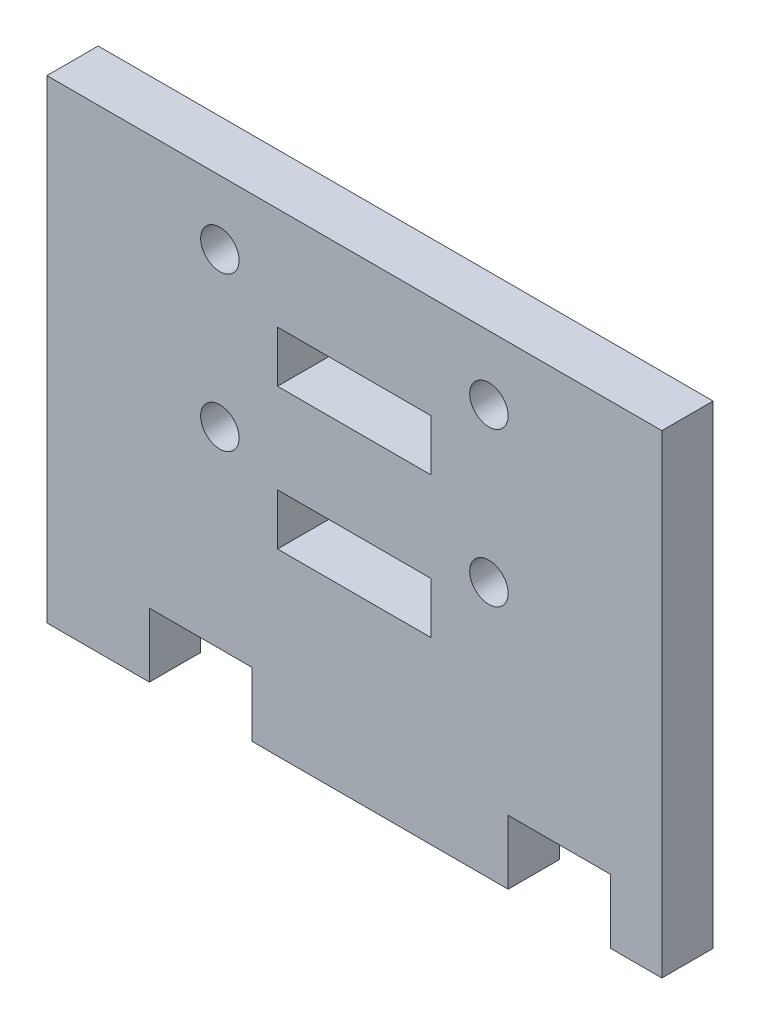
ISO-10303-21;
HEADER;
FILE_DESCRIPTION(('STEP AP214'),'2;1');
FILE_NAME('part.step','',(''),(''),'','','');
FILE_SCHEMA(('AUTOMOTIVE_DESIGN { 1 0 10303 214 1 1 1 1 }'));
ENDSEC;
DATA;
#1=APPLICATION_CONTEXT('core data for automotive mechanical design processes');
#2=APPLICATION_PROTOCOL_DEFINITION('international standard','automotive_design',2000,#1);
#3=PRODUCT_CONTEXT('',#1,'mechanical');
#4=PRODUCT('Part','Part','',(#3));
#5=PRODUCT_RELATED_PRODUCT_CATEGORY('part','',(#4));
#6=PRODUCT_DEFINITION_FORMATION('','',#4);
#7=PRODUCT_DEFINITION_CONTEXT('part definition',#1,'design');
#8=PRODUCT_DEFINITION('design','',#6,#7);
#9=PRODUCT_DEFINITION_SHAPE('','',#8);
#10=(LENGTH_UNIT() NAMED_UNIT(*) SI_UNIT(.MILLI.,.METRE.));
#11=(NAMED_UNIT(*) PLANE_ANGLE_UNIT() SI_UNIT($,.RADIAN.));
#12=(NAMED_UNIT(*) SI_UNIT($,.STERADIAN.) SOLID_ANGLE_UNIT());
#13=UNCERTAINTY_MEASURE_WITH_UNIT(LENGTH_MEASURE(1.E-05),#10,'distance_accuracy_value','');
#14=(GEOMETRIC_REPRESENTATION_CONTEXT(3) GLOBAL_UNCERTAINTY_ASSIGNED_CONTEXT((#13)) GLOBAL_UNIT_ASSIGNED_CONTEXT((#10,
#11,#12)) REPRESENTATION_CONTEXT('',''));
#15=CARTESIAN_POINT('',(0.,0.,0.));
#16=DIRECTION('',(0.,0.,1.));
#17=DIRECTION('',(1.,0.,0.));
#18=AXIS2_PLACEMENT_3D('',#15,#16,#17);
#19=CARTESIAN_POINT('',(0.,0.,2.));
#20=DIRECTION('',(0.,0.,-1.));
#21=DIRECTION('',(-1.,0.,0.));
#22=AXIS2_PLACEMENT_3D('',#19,#20,#21);
#23=PLANE('',#22);
#24=CARTESIAN_POINT('',(18.25,15.5,2.));
#25=DIRECTION('',(0.,0.,1.));
#26=DIRECTION('',(-1.,0.,0.));
#27=AXIS2_PLACEMENT_3D('',#24,#25,#26);
#28=CIRCLE('',#27,0.750000000000453);
#29=CARTESIAN_POINT('',(17.4999999999996,15.5,2.));
#30=VERTEX_POINT('',#29);
#31=EDGE_CURVE('E626',#30,#30,#28,.T.);
#32=ORIENTED_EDGE('',*,*,#31,.F.);
#33=EDGE_LOOP('',(#32));
#34=FACE_BOUND('',#33,.T.);
#35=DIRECTION('',(0.,-1.,0.));
#36=VECTOR('',#35,1.);
#37=CARTESIAN_POINT('',(10.,8.5,2.));
#38=LINE('',#37,#36);
#39=CARTESIAN_POINT('',(10.,8.5,2.));
#40=VERTEX_POINT('',#39);
#41=CARTESIAN_POINT('',(10.,6.5,2.));
#42=VERTEX_POINT('',#41);
#43=EDGE_CURVE('E169',#40,#42,#38,.T.);
#44=ORIENTED_EDGE('',*,*,#43,.F.);
#45=DIRECTION('',(-1.,0.,0.));
#46=VECTOR('',#45,1.);
#47=CARTESIAN_POINT('',(16.,8.5,2.));
#48=LINE('',#47,#46);
#49=CARTESIAN_POINT('',(16.,8.5,2.));
#50=VERTEX_POINT('',#49);
#51=EDGE_CURVE('E192',#50,#40,#48,.T.);
#52=ORIENTED_EDGE('',*,*,#51,.F.);
#53=DIRECTION('',(0.,1.,0.));
#54=VECTOR('',#53,1.);
#55=CARTESIAN_POINT('',(16.,6.5,2.));
#56=LINE('',#55,#54);
#57=CARTESIAN_POINT('',(16.,6.5,2.));
#58=VERTEX_POINT('',#57);
#59=EDGE_CURVE('E190',#58,#50,#56,.T.);
#60=ORIENTED_EDGE('',*,*,#59,.F.);
#61=DIRECTION('',(1.,0.,0.));
#62=VECTOR('',#61,1.);
#63=CARTESIAN_POINT('',(10.,6.5,2.));
#64=LINE('',#63,#62);
#65=EDGE_CURVE('E177',#42,#58,#64,.T.);
#66=ORIENTED_EDGE('',*,*,#65,.F.);
#67=EDGE_LOOP('',(#44,#52,#60,#66));
#68=FACE_BOUND('',#67,.T.);
#69=DIRECTION('',(1.,0.,0.));
#70=VECTOR('',#69,1.);
#71=CARTESIAN_POINT('',(10.,12.,2.));
#72=LINE('',#71,#70);
#73=CARTESIAN_POINT('',(10.,12.,2.));
#74=VERTEX_POINT('',#73);
#75=CARTESIAN_POINT('',(16.,12.,2.));
#76=VERTEX_POINT('',#75);
#77=EDGE_CURVE('E214',#74,#76,#72,.T.);
#78=ORIENTED_EDGE('',*,*,#77,.F.);
#79=DIRECTION('',(0.,-1.,0.));
#80=VECTOR('',#79,1.);
#81=CARTESIAN_POINT('',(10.,14.,2.));
#82=LINE('',#81,#80);
#83=CARTESIAN_POINT('',(10.,14.,2.));
#84=VERTEX_POINT('',#83);
#85=EDGE_CURVE('E222',#84,#74,#82,.T.);
#86=ORIENTED_EDGE('',*,*,#85,.F.);
#87=DIRECTION('',(-1.,0.,0.));
#88=VECTOR('',#87,1.);
#89=CARTESIAN_POINT('',(16.,14.,2.));
#90=LINE('',#89,#88);
#91=CARTESIAN_POINT('',(16.,14.,2.));
#92=VERTEX_POINT('',#91);
#93=EDGE_CURVE('E219',#92,#84,#90,.T.);
#94=ORIENTED_EDGE('',*,*,#93,.F.);
#95=DIRECTION('',(0.,1.,0.));
#96=VECTOR('',#95,1.);
#97=CARTESIAN_POINT('',(16.,12.,2.));
#98=LINE('',#97,#96);
#99=EDGE_CURVE('E216',#76,#92,#98,.T.);
#100=ORIENTED_EDGE('',*,*,#99,.F.);
#101=EDGE_LOOP('',(#78,#86,#94,#100));
#102=FACE_BOUND('',#101,.T.);
#103=DIRECTION('',(0.,-1.,0.));
#104=VECTOR('',#103,1.);
#105=CARTESIAN_POINT('',(0.999999999999993,-0.500000000000001,2.));
#106=LINE('',#105,#104);
#107=CARTESIAN_POINT('',(0.999999999999993,18.,2.));
#108=VERTEX_POINT('',#107);
#109=CARTESIAN_POINT('',(0.999999999999993,-0.500000000000001,2.));
#110=VERTEX_POINT('',#109);
#111=EDGE_CURVE('E245',#108,#110,#106,.T.);
#112=ORIENTED_EDGE('',*,*,#111,.T.);
#113=DIRECTION('',(1.,0.,0.));
#114=VECTOR('',#113,1.);
#115=CARTESIAN_POINT('',(4.99999999999999,-0.500000000000004,2.));
#116=LINE('',#115,#114);
#117=CARTESIAN_POINT('',(4.99999999999999,-0.500000000000004,2.));
#118=VERTEX_POINT('',#117);
#119=EDGE_CURVE('E248',#110,#118,#116,.T.);
#120=ORIENTED_EDGE('',*,*,#119,.T.);
#121=DIRECTION('',(0.,1.,0.));
#122=VECTOR('',#121,1.);
#123=CARTESIAN_POINT('',(4.99999999999999,1.99999999999999,2.));
#124=LINE('',#123,#122);
#125=CARTESIAN_POINT('',(4.99999999999999,1.99999999999999,2.));
#126=VERTEX_POINT('',#125);
#127=EDGE_CURVE('E251',#118,#126,#124,.T.);
#128=ORIENTED_EDGE('',*,*,#127,.T.);
#129=DIRECTION('',(1.,0.,0.));
#130=VECTOR('',#129,1.);
#131=CARTESIAN_POINT('',(4.99999999999999,1.99999999999999,2.));
#132=LINE('',#131,#130);
#133=CARTESIAN_POINT('',(8.99999999999999,2.,2.));
#134=VERTEX_POINT('',#133);
#135=EDGE_CURVE('E253',#126,#134,#132,.T.);
#136=ORIENTED_EDGE('',*,*,#135,.T.);
#137=DIRECTION('',(0.,-1.,0.));
#138=VECTOR('',#137,1.);
#139=CARTESIAN_POINT('',(8.99999999999999,-0.500000000000004,2.));
#140=LINE('',#139,#138);
#141=CARTESIAN_POINT('',(8.99999999999999,-0.500000000000004,2.));
#142=VERTEX_POINT('',#141);
#143=EDGE_CURVE('E255',#134,#142,#140,.T.);
#144=ORIENTED_EDGE('',*,*,#143,.T.);
#145=DIRECTION('',(1.,0.,0.));
#146=VECTOR('',#145,1.);
#147=CARTESIAN_POINT('',(8.99999999999999,-0.500000000000004,2.));
#148=LINE('',#147,#146);
#149=CARTESIAN_POINT('',(19.,-0.500000000000004,2.));
#150=VERTEX_POINT('',#149);
#151=EDGE_CURVE('E257',#142,#150,#148,.T.);
#152=ORIENTED_EDGE('',*,*,#151,.T.);
#153=DIRECTION('',(0.,1.,0.));
#154=VECTOR('',#153,1.);
#155=CARTESIAN_POINT('',(19.,-0.500000000000004,2.));
#156=LINE('',#155,#154);
#157=CARTESIAN_POINT('',(19.,2.,2.));
#158=VERTEX_POINT('',#157);
#159=EDGE_CURVE('E259',#150,#158,#156,.T.);
#160=ORIENTED_EDGE('',*,*,#159,.T.);
#161=DIRECTION('',(1.,0.,0.));
#162=VECTOR('',#161,1.);
#163=CARTESIAN_POINT('',(19.,2.,2.));
#164=LINE('',#163,#162);
#165=CARTESIAN_POINT('',(23.,2.,2.));
#166=VERTEX_POINT('',#165);
#167=EDGE_CURVE('E261',#158,#166,#164,.T.);
#168=ORIENTED_EDGE('',*,*,#167,.T.);
#169=DIRECTION('',(0.,-1.,0.));
#170=VECTOR('',#169,1.);
#171=CARTESIAN_POINT('',(23.,2.,2.));
#172=LINE('',#171,#170);
#173=CARTESIAN_POINT('',(23.,-0.500000000000004,2.));
#174=VERTEX_POINT('',#173);
#175=EDGE_CURVE('E263',#166,#174,#172,.T.);
#176=ORIENTED_EDGE('',*,*,#175,.T.);
#177=DIRECTION('',(1.,0.,0.));
#178=VECTOR('',#177,1.);
#179=CARTESIAN_POINT('',(23.,-0.500000000000004,2.));
#180=LINE('',#179,#178);
#181=CARTESIAN_POINT('',(25.,-0.500000000000004,2.));
#182=VERTEX_POINT('',#181);
#183=EDGE_CURVE('E265',#174,#182,#180,.T.);
#184=ORIENTED_EDGE('',*,*,#183,.T.);
#185=DIRECTION('',(0.,1.,0.));
#186=VECTOR('',#185,1.);
#187=CARTESIAN_POINT('',(25.,-0.500000000000004,2.));
#188=LINE('',#187,#186);
#189=CARTESIAN_POINT('',(25.,18.,2.));
#190=VERTEX_POINT('',#189);
#191=EDGE_CURVE('E267',#182,#190,#188,.T.);
#192=ORIENTED_EDGE('',*,*,#191,.T.);
#193=DIRECTION('',(-1.,0.,0.));
#194=VECTOR('',#193,1.);
#195=CARTESIAN_POINT('',(0.999999999999993,18.,2.));
#196=LINE('',#195,#194);
#197=EDGE_CURVE('E269',#190,#108,#196,.T.);
#198=ORIENTED_EDGE('',*,*,#197,.T.);
#199=EDGE_LOOP('',(#112,#120,#128,#136,#144,#152,#160,#168,#176,#184,#192,#198));
#200=FACE_BOUND('',#199,.T.);
#201=CARTESIAN_POINT('',(7.74999999999951,15.5,2.));
#202=DIRECTION('',(0.,0.,1.));
#203=DIRECTION('',(1.,0.,0.));
#204=AXIS2_PLACEMENT_3D('',#201,#202,#203);
#205=CIRCLE('',#204,0.750000000000003);
#206=CARTESIAN_POINT('',(8.49999999999952,15.5,2.));
#207=VERTEX_POINT('',#206);
#208=EDGE_CURVE('E208',#207,#207,#205,.T.);
#209=ORIENTED_EDGE('',*,*,#208,.F.);
#210=EDGE_LOOP('',(#209));
#211=FACE_BOUND('',#210,.T.);
#212=CARTESIAN_POINT('',(7.74999999999951,9.5,2.));
#213=DIRECTION('',(0.,0.,1.));
#214=DIRECTION('',(1.,0.,0.));
#215=AXIS2_PLACEMENT_3D('',#212,#213,#214);
#216=CIRCLE('',#215,0.750000000000002);
#217=CARTESIAN_POINT('',(8.49999999999952,9.5,2.));
#218=VERTEX_POINT('',#217);
#219=EDGE_CURVE('E198',#218,#218,#216,.T.);
#220=ORIENTED_EDGE('',*,*,#219,.F.);
#221=EDGE_LOOP('',(#220));
#222=FACE_BOUND('',#221,.T.);
#223=CARTESIAN_POINT('',(18.25,9.49999999999999,2.));
#224=DIRECTION('',(0.,0.,1.));
#225=DIRECTION('',(-1.,0.,0.));
#226=AXIS2_PLACEMENT_3D('',#223,#224,#225);
#227=CIRCLE('',#226,0.750000000000453);
#228=CARTESIAN_POINT('',(17.4999999999996,9.49999999999999,2.));
#229=VERTEX_POINT('',#228);
#230=EDGE_CURVE('E617',#229,#229,#227,.T.);
#231=ORIENTED_EDGE('',*,*,#230,.F.);
#232=EDGE_LOOP('',(#231));
#233=FACE_BOUND('',#232,.T.);
#234=ADVANCED_FACE('F32',(#34,#68,#102,#200,#211,#222,#233),#23,.F.);
#235=CARTESIAN_POINT('',(0.,0.,0.));
#236=DIRECTION('',(0.,0.,-1.));
#237=DIRECTION('',(-1.,0.,0.));
#238=AXIS2_PLACEMENT_3D('',#235,#236,#237);
#239=PLANE('',#238);
#240=CARTESIAN_POINT('',(18.25,15.5,0.));
#241=DIRECTION('',(0.,0.,1.));
#242=DIRECTION('',(-1.,0.,0.));
#243=AXIS2_PLACEMENT_3D('',#240,#241,#242);
#244=CIRCLE('',#243,0.750000000000453);
#245=CARTESIAN_POINT('',(17.4999999999996,15.5,0.));
#246=VERTEX_POINT('',#245);
#247=EDGE_CURVE('E623',#246,#246,#244,.T.);
#248=ORIENTED_EDGE('',*,*,#247,.T.);
#249=EDGE_LOOP('',(#248));
#250=FACE_BOUND('',#249,.T.);
#251=DIRECTION('',(-1.,0.,0.));
#252=VECTOR('',#251,1.);
#253=CARTESIAN_POINT('',(16.,8.5,0.));
#254=LINE('',#253,#252);
#255=CARTESIAN_POINT('',(16.,8.5,0.));
#256=VERTEX_POINT('',#255);
#257=CARTESIAN_POINT('',(10.,8.5,0.));
#258=VERTEX_POINT('',#257);
#259=EDGE_CURVE('E178',#256,#258,#254,.T.);
#260=ORIENTED_EDGE('',*,*,#259,.T.);
#261=DIRECTION('',(0.,-1.,0.));
#262=VECTOR('',#261,1.);
#263=CARTESIAN_POINT('',(10.,8.5,0.));
#264=LINE('',#263,#262);
#265=CARTESIAN_POINT('',(10.,6.5,0.));
#266=VERTEX_POINT('',#265);
#267=EDGE_CURVE('E55',#258,#266,#264,.T.);
#268=ORIENTED_EDGE('',*,*,#267,.T.);
#269=DIRECTION('',(1.,0.,0.));
#270=VECTOR('',#269,1.);
#271=CARTESIAN_POINT('',(10.,6.5,0.));
#272=LINE('',#271,#270);
#273=CARTESIAN_POINT('',(16.,6.5,0.));
#274=VERTEX_POINT('',#273);
#275=EDGE_CURVE('E184',#266,#274,#272,.T.);
#276=ORIENTED_EDGE('',*,*,#275,.T.);
#277=DIRECTION('',(0.,1.,0.));
#278=VECTOR('',#277,1.);
#279=CARTESIAN_POINT('',(16.,6.5,0.));
#280=LINE('',#279,#278);
#281=EDGE_CURVE('E200',#274,#256,#280,.T.);
#282=ORIENTED_EDGE('',*,*,#281,.T.);
#283=EDGE_LOOP('',(#260,#268,#276,#282));
#284=FACE_BOUND('',#283,.T.);
#285=DIRECTION('',(0.,-1.,0.));
#286=VECTOR('',#285,1.);
#287=CARTESIAN_POINT('',(10.,14.,0.));
#288=LINE('',#287,#286);
#289=CARTESIAN_POINT('',(10.,14.,0.));
#290=VERTEX_POINT('',#289);
#291=CARTESIAN_POINT('',(10.,12.,0.));
#292=VERTEX_POINT('',#291);
#293=EDGE_CURVE('E217',#290,#292,#288,.T.);
#294=ORIENTED_EDGE('',*,*,#293,.T.);
#295=DIRECTION('',(1.,0.,0.));
#296=VECTOR('',#295,1.);
#297=CARTESIAN_POINT('',(10.,12.,0.));
#298=LINE('',#297,#296);
#299=CARTESIAN_POINT('',(16.,12.,0.));
#300=VERTEX_POINT('',#299);
#301=EDGE_CURVE('E211',#292,#300,#298,.T.);
#302=ORIENTED_EDGE('',*,*,#301,.T.);
#303=DIRECTION('',(0.,1.,0.));
#304=VECTOR('',#303,1.);
#305=CARTESIAN_POINT('',(16.,12.,0.));
#306=LINE('',#305,#304);
#307=CARTESIAN_POINT('',(16.,14.,0.));
#308=VERTEX_POINT('',#307);
#309=EDGE_CURVE('E227',#300,#308,#306,.T.);
#310=ORIENTED_EDGE('',*,*,#309,.T.);
#311=DIRECTION('',(-1.,0.,0.));
#312=VECTOR('',#311,1.);
#313=CARTESIAN_POINT('',(16.,14.,0.));
#314=LINE('',#313,#312);
#315=EDGE_CURVE('E230',#308,#290,#314,.T.);
#316=ORIENTED_EDGE('',*,*,#315,.T.);
#317=EDGE_LOOP('',(#294,#302,#310,#316));
#318=FACE_BOUND('',#317,.T.);
#319=DIRECTION('',(0.,-1.,0.));
#320=VECTOR('',#319,1.);
#321=CARTESIAN_POINT('',(0.999999999999993,-0.500000000000001,0.));
#322=LINE('',#321,#320);
#323=CARTESIAN_POINT('',(0.999999999999993,18.,0.));
#324=VERTEX_POINT('',#323);
#325=CARTESIAN_POINT('',(0.999999999999993,-0.500000000000001,0.));
#326=VERTEX_POINT('',#325);
#327=EDGE_CURVE('E244',#324,#326,#322,.T.);
#328=ORIENTED_EDGE('',*,*,#327,.F.);
#329=DIRECTION('',(-1.,0.,0.));
#330=VECTOR('',#329,1.);
#331=CARTESIAN_POINT('',(0.999999999999993,18.,0.));
#332=LINE('',#331,#330);
#333=CARTESIAN_POINT('',(25.,18.,0.));
#334=VERTEX_POINT('',#333);
#335=EDGE_CURVE('E249',#334,#324,#332,.T.);
#336=ORIENTED_EDGE('',*,*,#335,.F.);
#337=DIRECTION('',(0.,1.,0.));
#338=VECTOR('',#337,1.);
#339=CARTESIAN_POINT('',(25.,-0.500000000000004,0.));
#340=LINE('',#339,#338);
#341=CARTESIAN_POINT('',(25.,-0.500000000000004,0.));
#342=VERTEX_POINT('',#341);
#343=EDGE_CURVE('E292',#342,#334,#340,.T.);
#344=ORIENTED_EDGE('',*,*,#343,.F.);
#345=DIRECTION('',(1.,0.,0.));
#346=VECTOR('',#345,1.);
#347=CARTESIAN_POINT('',(23.,-0.500000000000004,0.));
#348=LINE('',#347,#346);
#349=CARTESIAN_POINT('',(23.,-0.500000000000004,0.));
#350=VERTEX_POINT('',#349);
#351=EDGE_CURVE('E290',#350,#342,#348,.T.);
#352=ORIENTED_EDGE('',*,*,#351,.F.);
#353=DIRECTION('',(0.,-1.,0.));
#354=VECTOR('',#353,1.);
#355=CARTESIAN_POINT('',(23.,2.,0.));
#356=LINE('',#355,#354);
#357=CARTESIAN_POINT('',(23.,2.,0.));
#358=VERTEX_POINT('',#357);
#359=EDGE_CURVE('E288',#358,#350,#356,.T.);
#360=ORIENTED_EDGE('',*,*,#359,.F.);
#361=DIRECTION('',(1.,0.,0.));
#362=VECTOR('',#361,1.);
#363=CARTESIAN_POINT('',(19.,2.,0.));
#364=LINE('',#363,#362);
#365=CARTESIAN_POINT('',(19.,2.,0.));
#366=VERTEX_POINT('',#365);
#367=EDGE_CURVE('E286',#366,#358,#364,.T.);
#368=ORIENTED_EDGE('',*,*,#367,.F.);
#369=DIRECTION('',(0.,1.,0.));
#370=VECTOR('',#369,1.);
#371=CARTESIAN_POINT('',(19.,-0.500000000000004,0.));
#372=LINE('',#371,#370);
#373=CARTESIAN_POINT('',(19.,-0.500000000000004,0.));
#374=VERTEX_POINT('',#373);
#375=EDGE_CURVE('E284',#374,#366,#372,.T.);
#376=ORIENTED_EDGE('',*,*,#375,.F.);
#377=DIRECTION('',(1.,0.,0.));
#378=VECTOR('',#377,1.);
#379=CARTESIAN_POINT('',(8.99999999999999,-0.500000000000004,0.));
#380=LINE('',#379,#378);
#381=CARTESIAN_POINT('',(8.99999999999999,-0.500000000000004,0.));
#382=VERTEX_POINT('',#381);
#383=EDGE_CURVE('E282',#382,#374,#380,.T.);
#384=ORIENTED_EDGE('',*,*,#383,.F.);
#385=DIRECTION('',(0.,-1.,0.));
#386=VECTOR('',#385,1.);
#387=CARTESIAN_POINT('',(8.99999999999999,-0.500000000000004,0.));
#388=LINE('',#387,#386);
#389=CARTESIAN_POINT('',(8.99999999999999,2.,0.));
#390=VERTEX_POINT('',#389);
#391=EDGE_CURVE('E280',#390,#382,#388,.T.);
#392=ORIENTED_EDGE('',*,*,#391,.F.);
#393=DIRECTION('',(1.,0.,0.));
#394=VECTOR('',#393,1.);
#395=CARTESIAN_POINT('',(4.99999999999999,1.99999999999999,0.));
#396=LINE('',#395,#394);
#397=CARTESIAN_POINT('',(4.99999999999999,1.99999999999999,0.));
#398=VERTEX_POINT('',#397);
#399=EDGE_CURVE('E278',#398,#390,#396,.T.);
#400=ORIENTED_EDGE('',*,*,#399,.F.);
#401=DIRECTION('',(0.,1.,0.));
#402=VECTOR('',#401,1.);
#403=CARTESIAN_POINT('',(4.99999999999999,1.99999999999999,0.));
#404=LINE('',#403,#402);
#405=CARTESIAN_POINT('',(4.99999999999999,-0.500000000000004,0.));
#406=VERTEX_POINT('',#405);
#407=EDGE_CURVE('E276',#406,#398,#404,.T.);
#408=ORIENTED_EDGE('',*,*,#407,.F.);
#409=DIRECTION('',(1.,0.,0.));
#410=VECTOR('',#409,1.);
#411=CARTESIAN_POINT('',(4.99999999999999,-0.500000000000004,0.));
#412=LINE('',#411,#410);
#413=EDGE_CURVE('E274',#326,#406,#412,.T.);
#414=ORIENTED_EDGE('',*,*,#413,.F.);
#415=EDGE_LOOP('',(#328,#336,#344,#352,#360,#368,#376,#384,#392,#400,#408,#414));
#416=FACE_BOUND('',#415,.T.);
#417=CARTESIAN_POINT('',(7.74999999999951,15.5,0.));
#418=DIRECTION('',(0.,0.,1.));
#419=DIRECTION('',(1.,0.,0.));
#420=AXIS2_PLACEMENT_3D('',#417,#418,#419);
#421=CIRCLE('',#420,0.750000000000003);
#422=CARTESIAN_POINT('',(8.49999999999952,15.5,0.));
#423=VERTEX_POINT('',#422);
#424=EDGE_CURVE('E185',#423,#423,#421,.T.);
#425=ORIENTED_EDGE('',*,*,#424,.T.);
#426=EDGE_LOOP('',(#425));
#427=FACE_BOUND('',#426,.T.);
#428=CARTESIAN_POINT('',(7.74999999999951,9.5,0.));
#429=DIRECTION('',(0.,0.,1.));
#430=DIRECTION('',(1.,0.,0.));
#431=AXIS2_PLACEMENT_3D('',#428,#429,#430);
#432=CIRCLE('',#431,0.750000000000002);
#433=CARTESIAN_POINT('',(8.49999999999952,9.5,0.));
#434=VERTEX_POINT('',#433);
#435=EDGE_CURVE('E629',#434,#434,#432,.T.);
#436=ORIENTED_EDGE('',*,*,#435,.T.);
#437=EDGE_LOOP('',(#436));
#438=FACE_BOUND('',#437,.T.);
#439=CARTESIAN_POINT('',(18.25,9.49999999999999,0.));
#440=DIRECTION('',(0.,0.,1.));
#441=DIRECTION('',(-1.,0.,0.));
#442=AXIS2_PLACEMENT_3D('',#439,#440,#441);
#443=CIRCLE('',#442,0.750000000000453);
#444=CARTESIAN_POINT('',(17.4999999999996,9.49999999999999,0.));
#445=VERTEX_POINT('',#444);
#446=EDGE_CURVE('E620',#445,#445,#443,.T.);
#447=ORIENTED_EDGE('',*,*,#446,.T.);
#448=EDGE_LOOP('',(#447));
#449=FACE_BOUND('',#448,.T.);
#450=ADVANCED_FACE('F334',(#250,#284,#318,#416,#427,#438,#449),#239,.T.);
#451=CARTESIAN_POINT('',(0.999999999999993,-0.500000000000001,2.));
#452=DIRECTION('',(1.,0.,0.));
#453=DIRECTION('',(0.,0.,-1.));
#454=AXIS2_PLACEMENT_3D('',#451,#452,#453);
#455=PLANE('',#454);
#456=ORIENTED_EDGE('',*,*,#327,.T.);
#457=DIRECTION('',(0.,0.,-1.));
#458=VECTOR('',#457,1.);
#459=CARTESIAN_POINT('',(0.999999999999993,-0.500000000000001,2.));
#460=LINE('',#459,#458);
#461=EDGE_CURVE('E11',#110,#326,#460,.T.);
#462=ORIENTED_EDGE('',*,*,#461,.F.);
#463=ORIENTED_EDGE('',*,*,#111,.F.);
#464=DIRECTION('',(0.,0.,-1.));
#465=VECTOR('',#464,1.);
#466=CARTESIAN_POINT('',(0.999999999999993,18.,2.));
#467=LINE('',#466,#465);
#468=EDGE_CURVE('E271',#108,#324,#467,.T.);
#469=ORIENTED_EDGE('',*,*,#468,.T.);
#470=EDGE_LOOP('',(#456,#462,#463,#469));
#471=FACE_BOUND('',#470,.T.);
#472=ADVANCED_FACE('F34',(#471),#455,.F.);
#473=CARTESIAN_POINT('',(4.99999999999999,-0.500000000000004,2.));
#474=DIRECTION('',(0.,1.,0.));
#475=DIRECTION('',(-1.,0.,0.));
#476=AXIS2_PLACEMENT_3D('',#473,#474,#475);
#477=PLANE('',#476);
#478=ORIENTED_EDGE('',*,*,#413,.T.);
#479=DIRECTION('',(0.,0.,-1.));
#480=VECTOR('',#479,1.);
#481=CARTESIAN_POINT('',(4.99999999999999,-0.500000000000004,2.));
#482=LINE('',#481,#480);
#483=EDGE_CURVE('E40',#118,#406,#482,.T.);
#484=ORIENTED_EDGE('',*,*,#483,.F.);
#485=ORIENTED_EDGE('',*,*,#119,.F.);
#486=ORIENTED_EDGE('',*,*,#461,.T.);
#487=EDGE_LOOP('',(#478,#484,#485,#486));
#488=FACE_BOUND('',#487,.T.);
#489=ADVANCED_FACE('F352',(#488),#477,.F.);
#490=CARTESIAN_POINT('',(4.99999999999999,1.99999999999999,2.));
#491=DIRECTION('',(-1.,0.,0.));
#492=DIRECTION('',(0.,-1.,0.));
#493=AXIS2_PLACEMENT_3D('',#490,#491,#492);
#494=PLANE('',#493);
#495=ORIENTED_EDGE('',*,*,#407,.T.);
#496=DIRECTION('',(0.,0.,-1.));
#497=VECTOR('',#496,1.);
#498=CARTESIAN_POINT('',(4.99999999999999,1.99999999999999,2.));
#499=LINE('',#498,#497);
#500=EDGE_CURVE('E321',#126,#398,#499,.T.);
#501=ORIENTED_EDGE('',*,*,#500,.F.);
#502=ORIENTED_EDGE('',*,*,#127,.F.);
#503=ORIENTED_EDGE('',*,*,#483,.T.);
#504=EDGE_LOOP('',(#495,#501,#502,#503));
#505=FACE_BOUND('',#504,.T.);
#506=ADVANCED_FACE('F328',(#505),#494,.F.);
#507=CARTESIAN_POINT('',(4.99999999999999,1.99999999999999,2.));
#508=DIRECTION('',(0.,1.,0.));
#509=DIRECTION('',(-1.,0.,0.));
#510=AXIS2_PLACEMENT_3D('',#507,#508,#509);
#511=PLANE('',#510);
#512=ORIENTED_EDGE('',*,*,#399,.T.);
#513=DIRECTION('',(0.,0.,-1.));
#514=VECTOR('',#513,1.);
#515=CARTESIAN_POINT('',(8.99999999999999,2.,2.));
#516=LINE('',#515,#514);
#517=EDGE_CURVE('E318',#134,#390,#516,.T.);
#518=ORIENTED_EDGE('',*,*,#517,.F.);
#519=ORIENTED_EDGE('',*,*,#135,.F.);
#520=ORIENTED_EDGE('',*,*,#500,.T.);
#521=EDGE_LOOP('',(#512,#518,#519,#520));
#522=FACE_BOUND('',#521,.T.);
#523=ADVANCED_FACE('F340',(#522),#511,.F.);
#524=CARTESIAN_POINT('',(8.99999999999999,-0.500000000000004,2.));
#525=DIRECTION('',(1.,0.,0.));
#526=DIRECTION('',(0.,0.,-1.));
#527=AXIS2_PLACEMENT_3D('',#524,#525,#526);
#528=PLANE('',#527);
#529=ORIENTED_EDGE('',*,*,#391,.T.);
#530=DIRECTION('',(0.,0.,-1.));
#531=VECTOR('',#530,1.);
#532=CARTESIAN_POINT('',(8.99999999999999,-0.500000000000004,2.));
#533=LINE('',#532,#531);
#534=EDGE_CURVE('E315',#142,#382,#533,.T.);
#535=ORIENTED_EDGE('',*,*,#534,.F.);
#536=ORIENTED_EDGE('',*,*,#143,.F.);
#537=ORIENTED_EDGE('',*,*,#517,.T.);
#538=EDGE_LOOP('',(#529,#535,#536,#537));
#539=FACE_BOUND('',#538,.T.);
#540=ADVANCED_FACE('F344',(#539),#528,.F.);
#541=CARTESIAN_POINT('',(8.99999999999999,-0.500000000000004,2.));
#542=DIRECTION('',(0.,1.,0.));
#543=DIRECTION('',(-1.,0.,0.));
#544=AXIS2_PLACEMENT_3D('',#541,#542,#543);
#545=PLANE('',#544);
#546=ORIENTED_EDGE('',*,*,#383,.T.);
#547=DIRECTION('',(0.,0.,-1.));
#548=VECTOR('',#547,1.);
#549=CARTESIAN_POINT('',(19.,-0.500000000000004,2.));
#550=LINE('',#549,#548);
#551=EDGE_CURVE('E312',#150,#374,#550,.T.);
#552=ORIENTED_EDGE('',*,*,#551,.F.);
#553=ORIENTED_EDGE('',*,*,#151,.F.);
#554=ORIENTED_EDGE('',*,*,#534,.T.);
#555=EDGE_LOOP('',(#546,#552,#553,#554));
#556=FACE_BOUND('',#555,.T.);
#557=ADVANCED_FACE('F385',(#556),#545,.F.);
#558=CARTESIAN_POINT('',(19.,-0.500000000000004,2.));
#559=DIRECTION('',(-1.,0.,0.));
#560=DIRECTION('',(0.,0.,1.));
#561=AXIS2_PLACEMENT_3D('',#558,#559,#560);
#562=PLANE('',#561);
#563=ORIENTED_EDGE('',*,*,#375,.T.);
#564=DIRECTION('',(0.,0.,-1.));
#565=VECTOR('',#564,1.);
#566=CARTESIAN_POINT('',(19.,2.,2.));
#567=LINE('',#566,#565);
#568=EDGE_CURVE('E309',#158,#366,#567,.T.);
#569=ORIENTED_EDGE('',*,*,#568,.F.);
#570=ORIENTED_EDGE('',*,*,#159,.F.);
#571=ORIENTED_EDGE('',*,*,#551,.T.);
#572=EDGE_LOOP('',(#563,#569,#570,#571));
#573=FACE_BOUND('',#572,.T.);
#574=ADVANCED_FACE('F383',(#573),#562,.F.);
#575=CARTESIAN_POINT('',(19.,2.,2.));
#576=DIRECTION('',(0.,1.,0.));
#577=DIRECTION('',(-1.,0.,0.));
#578=AXIS2_PLACEMENT_3D('',#575,#576,#577);
#579=PLANE('',#578);
#580=ORIENTED_EDGE('',*,*,#367,.T.);
#581=DIRECTION('',(0.,0.,-1.));
#582=VECTOR('',#581,1.);
#583=CARTESIAN_POINT('',(23.,2.,2.));
#584=LINE('',#583,#582);
#585=EDGE_CURVE('E306',#166,#358,#584,.T.);
#586=ORIENTED_EDGE('',*,*,#585,.F.);
#587=ORIENTED_EDGE('',*,*,#167,.F.);
#588=ORIENTED_EDGE('',*,*,#568,.T.);
#589=EDGE_LOOP('',(#580,#586,#587,#588));
#590=FACE_BOUND('',#589,.T.);
#591=ADVANCED_FACE('F379',(#590),#579,.F.);
#592=CARTESIAN_POINT('',(23.,2.,2.));
#593=DIRECTION('',(1.,0.,0.));
#594=DIRECTION('',(0.,1.,0.));
#595=AXIS2_PLACEMENT_3D('',#592,#593,#594);
#596=PLANE('',#595);
#597=ORIENTED_EDGE('',*,*,#359,.T.);
#598=DIRECTION('',(0.,0.,-1.));
#599=VECTOR('',#598,1.);
#600=CARTESIAN_POINT('',(23.,-0.500000000000004,2.));
#601=LINE('',#600,#599);
#602=EDGE_CURVE('E303',#174,#350,#601,.T.);
#603=ORIENTED_EDGE('',*,*,#602,.F.);
#604=ORIENTED_EDGE('',*,*,#175,.F.);
#605=ORIENTED_EDGE('',*,*,#585,.T.);
#606=EDGE_LOOP('',(#597,#603,#604,#605));
#607=FACE_BOUND('',#606,.T.);
#608=ADVANCED_FACE('F374',(#607),#596,.F.);
#609=CARTESIAN_POINT('',(23.,-0.500000000000004,2.));
#610=DIRECTION('',(0.,1.,0.));
#611=DIRECTION('',(0.,0.,1.));
#612=AXIS2_PLACEMENT_3D('',#609,#610,#611);
#613=PLANE('',#612);
#614=ORIENTED_EDGE('',*,*,#351,.T.);
#615=DIRECTION('',(0.,0.,-1.));
#616=VECTOR('',#615,1.);
#617=CARTESIAN_POINT('',(25.,-0.500000000000004,2.));
#618=LINE('',#617,#616);
#619=EDGE_CURVE('E300',#182,#342,#618,.T.);
#620=ORIENTED_EDGE('',*,*,#619,.F.);
#621=ORIENTED_EDGE('',*,*,#183,.F.);
#622=ORIENTED_EDGE('',*,*,#602,.T.);
#623=EDGE_LOOP('',(#614,#620,#621,#622));
#624=FACE_BOUND('',#623,.T.);
#625=ADVANCED_FACE('F368',(#624),#613,.F.);
#626=CARTESIAN_POINT('',(25.,-0.500000000000004,2.));
#627=DIRECTION('',(-1.,0.,0.));
#628=DIRECTION('',(0.,0.,1.));
#629=AXIS2_PLACEMENT_3D('',#626,#627,#628);
#630=PLANE('',#629);
#631=ORIENTED_EDGE('',*,*,#343,.T.);
#632=DIRECTION('',(0.,0.,-1.));
#633=VECTOR('',#632,1.);
#634=CARTESIAN_POINT('',(25.,18.,2.));
#635=LINE('',#634,#633);
#636=EDGE_CURVE('E297',#190,#334,#635,.T.);
#637=ORIENTED_EDGE('',*,*,#636,.F.);
#638=ORIENTED_EDGE('',*,*,#191,.F.);
#639=ORIENTED_EDGE('',*,*,#619,.T.);
#640=EDGE_LOOP('',(#631,#637,#638,#639));
#641=FACE_BOUND('',#640,.T.);
#642=ADVANCED_FACE('F364',(#641),#630,.F.);
#643=CARTESIAN_POINT('',(0.999999999999993,18.,2.));
#644=DIRECTION('',(0.,-1.,0.));
#645=DIRECTION('',(0.,0.,-1.));
#646=AXIS2_PLACEMENT_3D('',#643,#644,#645);
#647=PLANE('',#646);
#648=ORIENTED_EDGE('',*,*,#335,.T.);
#649=ORIENTED_EDGE('',*,*,#468,.F.);
#650=ORIENTED_EDGE('',*,*,#197,.F.);
#651=ORIENTED_EDGE('',*,*,#636,.T.);
#652=EDGE_LOOP('',(#648,#649,#650,#651));
#653=FACE_BOUND('',#652,.T.);
#654=ADVANCED_FACE('F359',(#653),#647,.F.);
#655=CARTESIAN_POINT('',(10.,12.,2.));
#656=DIRECTION('',(0.,1.,0.));
#657=DIRECTION('',(0.,0.,1.));
#658=AXIS2_PLACEMENT_3D('',#655,#656,#657);
#659=PLANE('',#658);
#660=ORIENTED_EDGE('',*,*,#301,.F.);
#661=DIRECTION('',(0.,0.,-1.));
#662=VECTOR('',#661,1.);
#663=CARTESIAN_POINT('',(10.,12.,2.));
#664=LINE('',#663,#662);
#665=EDGE_CURVE('E224',#74,#292,#664,.T.);
#666=ORIENTED_EDGE('',*,*,#665,.F.);
#667=ORIENTED_EDGE('',*,*,#77,.T.);
#668=DIRECTION('',(0.,0.,-1.));
#669=VECTOR('',#668,1.);
#670=CARTESIAN_POINT('',(16.,12.,2.));
#671=LINE('',#670,#669);
#672=EDGE_CURVE('E241',#76,#300,#671,.T.);
#673=ORIENTED_EDGE('',*,*,#672,.T.);
#674=EDGE_LOOP('',(#660,#666,#667,#673));
#675=FACE_BOUND('',#674,.T.);
#676=ADVANCED_FACE('F404',(#675),#659,.T.);
#677=CARTESIAN_POINT('',(16.,12.,2.));
#678=DIRECTION('',(-1.,0.,0.));
#679=DIRECTION('',(0.,0.,1.));
#680=AXIS2_PLACEMENT_3D('',#677,#678,#679);
#681=PLANE('',#680);
#682=ORIENTED_EDGE('',*,*,#309,.F.);
#683=ORIENTED_EDGE('',*,*,#672,.F.);
#684=ORIENTED_EDGE('',*,*,#99,.T.);
#685=DIRECTION('',(0.,0.,-1.));
#686=VECTOR('',#685,1.);
#687=CARTESIAN_POINT('',(16.,14.,2.));
#688=LINE('',#687,#686);
#689=EDGE_CURVE('E239',#92,#308,#688,.T.);
#690=ORIENTED_EDGE('',*,*,#689,.T.);
#691=EDGE_LOOP('',(#682,#683,#684,#690));
#692=FACE_BOUND('',#691,.T.);
#693=ADVANCED_FACE('F442',(#692),#681,.T.);
#694=CARTESIAN_POINT('',(16.,14.,2.));
#695=DIRECTION('',(0.,-1.,0.));
#696=DIRECTION('',(0.,0.,-1.));
#697=AXIS2_PLACEMENT_3D('',#694,#695,#696);
#698=PLANE('',#697);
#699=ORIENTED_EDGE('',*,*,#315,.F.);
#700=ORIENTED_EDGE('',*,*,#689,.F.);
#701=ORIENTED_EDGE('',*,*,#93,.T.);
#702=DIRECTION('',(0.,0.,-1.));
#703=VECTOR('',#702,1.);
#704=CARTESIAN_POINT('',(10.,14.,2.));
#705=LINE('',#704,#703);
#706=EDGE_CURVE('E237',#84,#290,#705,.T.);
#707=ORIENTED_EDGE('',*,*,#706,.T.);
#708=EDGE_LOOP('',(#699,#700,#701,#707));
#709=FACE_BOUND('',#708,.T.);
#710=ADVANCED_FACE('F449',(#709),#698,.T.);
#711=CARTESIAN_POINT('',(10.,14.,2.));
#712=DIRECTION('',(1.,0.,0.));
#713=DIRECTION('',(0.,0.,-1.));
#714=AXIS2_PLACEMENT_3D('',#711,#712,#713);
#715=PLANE('',#714);
#716=ORIENTED_EDGE('',*,*,#293,.F.);
#717=ORIENTED_EDGE('',*,*,#706,.F.);
#718=ORIENTED_EDGE('',*,*,#85,.T.);
#719=ORIENTED_EDGE('',*,*,#665,.T.);
#720=EDGE_LOOP('',(#716,#717,#718,#719));
#721=FACE_BOUND('',#720,.T.);
#722=ADVANCED_FACE('F456',(#721),#715,.T.);
#723=CARTESIAN_POINT('',(7.74999999999951,15.5,2.));
#724=DIRECTION('',(0.,0.,-1.));
#725=DIRECTION('',(-1.,0.,0.));
#726=AXIS2_PLACEMENT_3D('',#723,#724,#725);
#727=CYLINDRICAL_SURFACE('',#726,0.750000000000003);
#728=ORIENTED_EDGE('',*,*,#208,.T.);
#729=EDGE_LOOP('',(#728));
#730=FACE_BOUND('',#729,.T.);
#731=ORIENTED_EDGE('',*,*,#424,.F.);
#732=EDGE_LOOP('',(#731));
#733=FACE_BOUND('',#732,.T.);
#734=ADVANCED_FACE('F464',(#730,#733),#727,.F.);
#735=CARTESIAN_POINT('',(10.,8.5,2.));
#736=DIRECTION('',(1.,0.,0.));
#737=DIRECTION('',(0.,0.,-1.));
#738=AXIS2_PLACEMENT_3D('',#735,#736,#737);
#739=PLANE('',#738);
#740=ORIENTED_EDGE('',*,*,#267,.F.);
#741=DIRECTION('',(0.,0.,-1.));
#742=VECTOR('',#741,1.);
#743=CARTESIAN_POINT('',(10.,8.5,2.));
#744=LINE('',#743,#742);
#745=EDGE_CURVE('E173',#40,#258,#744,.T.);
#746=ORIENTED_EDGE('',*,*,#745,.F.);
#747=ORIENTED_EDGE('',*,*,#43,.T.);
#748=DIRECTION('',(0.,0.,-1.));
#749=VECTOR('',#748,1.);
#750=CARTESIAN_POINT('',(10.,6.5,2.));
#751=LINE('',#750,#749);
#752=EDGE_CURVE('E172',#42,#266,#751,.T.);
#753=ORIENTED_EDGE('',*,*,#752,.T.);
#754=EDGE_LOOP('',(#740,#746,#747,#753));
#755=FACE_BOUND('',#754,.T.);
#756=ADVANCED_FACE('F171',(#755),#739,.T.);
#757=CARTESIAN_POINT('',(10.,6.5,2.));
#758=DIRECTION('',(0.,1.,0.));
#759=DIRECTION('',(0.,0.,1.));
#760=AXIS2_PLACEMENT_3D('',#757,#758,#759);
#761=PLANE('',#760);
#762=ORIENTED_EDGE('',*,*,#275,.F.);
#763=ORIENTED_EDGE('',*,*,#752,.F.);
#764=ORIENTED_EDGE('',*,*,#65,.T.);
#765=DIRECTION('',(0.,0.,-1.));
#766=VECTOR('',#765,1.);
#767=CARTESIAN_POINT('',(16.,6.5,2.));
#768=LINE('',#767,#766);
#769=EDGE_CURVE('E186',#58,#274,#768,.T.);
#770=ORIENTED_EDGE('',*,*,#769,.T.);
#771=EDGE_LOOP('',(#762,#763,#764,#770));
#772=FACE_BOUND('',#771,.T.);
#773=ADVANCED_FACE('F181',(#772),#761,.T.);
#774=CARTESIAN_POINT('',(16.,6.5,2.));
#775=DIRECTION('',(-1.,0.,0.));
#776=DIRECTION('',(0.,0.,1.));
#777=AXIS2_PLACEMENT_3D('',#774,#775,#776);
#778=PLANE('',#777);
#779=ORIENTED_EDGE('',*,*,#281,.F.);
#780=ORIENTED_EDGE('',*,*,#769,.F.);
#781=ORIENTED_EDGE('',*,*,#59,.T.);
#782=DIRECTION('',(0.,0.,-1.));
#783=VECTOR('',#782,1.);
#784=CARTESIAN_POINT('',(16.,8.5,2.));
#785=LINE('',#784,#783);
#786=EDGE_CURVE('E47',#50,#256,#785,.T.);
#787=ORIENTED_EDGE('',*,*,#786,.T.);
#788=EDGE_LOOP('',(#779,#780,#781,#787));
#789=FACE_BOUND('',#788,.T.);
#790=ADVANCED_FACE('F485',(#789),#778,.T.);
#791=CARTESIAN_POINT('',(16.,8.5,2.));
#792=DIRECTION('',(0.,-1.,0.));
#793=DIRECTION('',(0.,0.,-1.));
#794=AXIS2_PLACEMENT_3D('',#791,#792,#793);
#795=PLANE('',#794);
#796=ORIENTED_EDGE('',*,*,#259,.F.);
#797=ORIENTED_EDGE('',*,*,#786,.F.);
#798=ORIENTED_EDGE('',*,*,#51,.T.);
#799=ORIENTED_EDGE('',*,*,#745,.T.);
#800=EDGE_LOOP('',(#796,#797,#798,#799));
#801=FACE_BOUND('',#800,.T.);
#802=ADVANCED_FACE('F492',(#801),#795,.T.);
#803=CARTESIAN_POINT('',(7.74999999999951,9.5,2.));
#804=DIRECTION('',(0.,0.,-1.));
#805=DIRECTION('',(-1.,0.,0.));
#806=AXIS2_PLACEMENT_3D('',#803,#804,#805);
#807=CYLINDRICAL_SURFACE('',#806,0.750000000000002);
#808=ORIENTED_EDGE('',*,*,#219,.T.);
#809=EDGE_LOOP('',(#808));
#810=FACE_BOUND('',#809,.T.);
#811=ORIENTED_EDGE('',*,*,#435,.F.);
#812=EDGE_LOOP('',(#811));
#813=FACE_BOUND('',#812,.T.);
#814=ADVANCED_FACE('F500',(#810,#813),#807,.F.);
#815=CARTESIAN_POINT('',(18.25,15.5,2.));
#816=DIRECTION('',(0.,0.,-1.));
#817=DIRECTION('',(-1.,0.,0.));
#818=AXIS2_PLACEMENT_3D('',#815,#816,#817);
#819=CYLINDRICAL_SURFACE('',#818,0.750000000000453);
#820=ORIENTED_EDGE('',*,*,#31,.T.);
#821=EDGE_LOOP('',(#820));
#822=FACE_BOUND('',#821,.T.);
#823=ORIENTED_EDGE('',*,*,#247,.F.);
#824=EDGE_LOOP('',(#823));
#825=FACE_BOUND('',#824,.T.);
#826=ADVANCED_FACE('F507',(#822,#825),#819,.F.);
#827=CARTESIAN_POINT('',(18.25,9.49999999999999,2.));
#828=DIRECTION('',(0.,0.,-1.));
#829=DIRECTION('',(-1.,0.,0.));
#830=AXIS2_PLACEMENT_3D('',#827,#828,#829);
#831=CYLINDRICAL_SURFACE('',#830,0.750000000000453);
#832=ORIENTED_EDGE('',*,*,#230,.T.);
#833=EDGE_LOOP('',(#832));
#834=FACE_BOUND('',#833,.T.);
#835=ORIENTED_EDGE('',*,*,#446,.F.);
#836=EDGE_LOOP('',(#835));
#837=FACE_BOUND('',#836,.T.);
#838=ADVANCED_FACE('F515',(#834,#837),#831,.F.);
#839=CLOSED_SHELL('',(#234,#450,#472,#489,#506,#523,#540,#557,#574,#591,#608,#625,#642,#654,
#676,#693,#710,#722,#734,#756,#773,#790,#802,#814,#826,#838));
#840=MANIFOLD_SOLID_BREP('B2',#839);
#841=ADVANCED_BREP_SHAPE_REPRESENTATION('',(#18,#840),#14);
#842=SHAPE_DEFINITION_REPRESENTATION(#9,#841);
ENDSEC;
END-ISO-10303-21;
